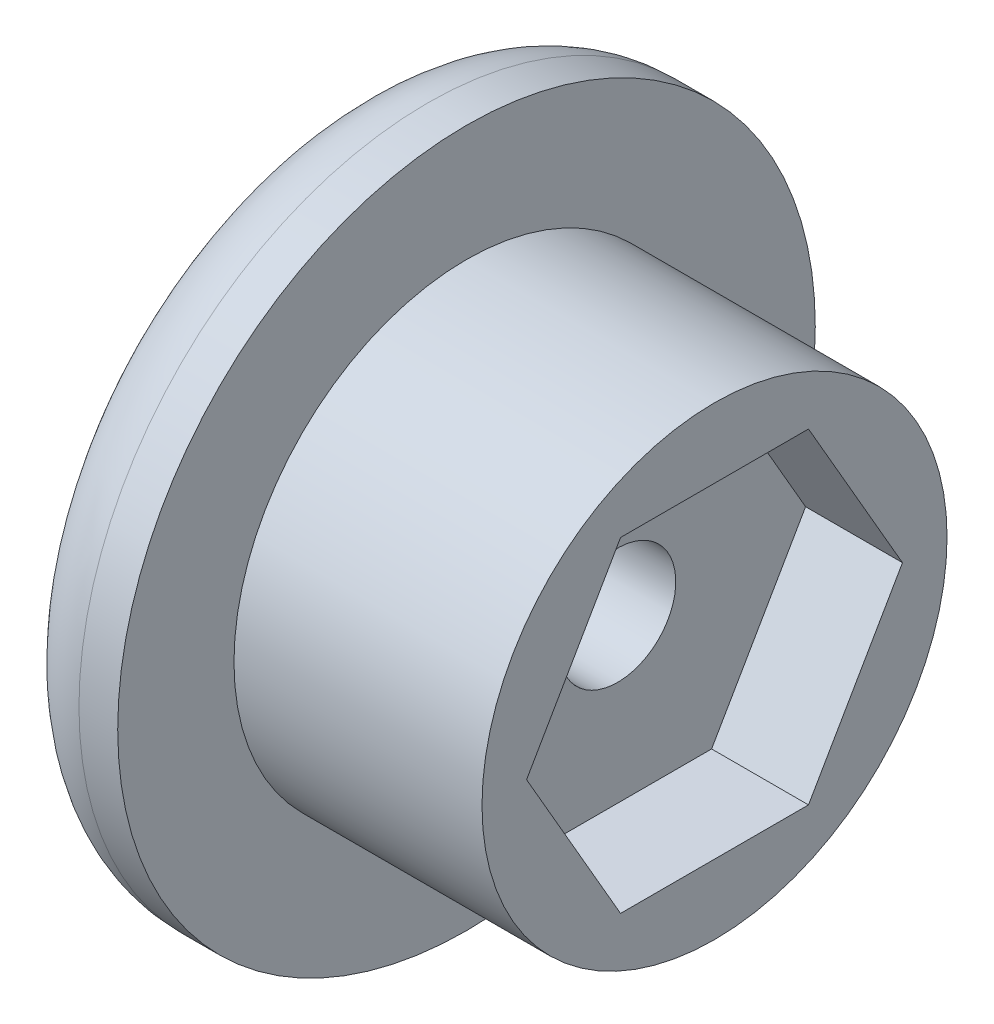
ISO-10303-21;
HEADER;
FILE_DESCRIPTION(('STEP AP214'),'2;1');
FILE_NAME('part.step','',(''),(''),'','','');
FILE_SCHEMA(('AUTOMOTIVE_DESIGN { 1 0 10303 214 1 1 1 1 }'));
ENDSEC;
DATA;
#1=APPLICATION_CONTEXT('core data for automotive mechanical design processes');
#2=APPLICATION_PROTOCOL_DEFINITION('international standard','automotive_design',2000,#1);
#3=PRODUCT_CONTEXT('',#1,'mechanical');
#4=PRODUCT('Part','Part','',(#3));
#5=PRODUCT_RELATED_PRODUCT_CATEGORY('part','',(#4));
#6=PRODUCT_DEFINITION_FORMATION('','',#4);
#7=PRODUCT_DEFINITION_CONTEXT('part definition',#1,'design');
#8=PRODUCT_DEFINITION('design','',#6,#7);
#9=PRODUCT_DEFINITION_SHAPE('','',#8);
#10=(LENGTH_UNIT() NAMED_UNIT(*) SI_UNIT(.MILLI.,.METRE.));
#11=(NAMED_UNIT(*) PLANE_ANGLE_UNIT() SI_UNIT($,.RADIAN.));
#12=(NAMED_UNIT(*) SI_UNIT($,.STERADIAN.) SOLID_ANGLE_UNIT());
#13=UNCERTAINTY_MEASURE_WITH_UNIT(LENGTH_MEASURE(1.E-05),#10,'distance_accuracy_value','');
#14=(GEOMETRIC_REPRESENTATION_CONTEXT(3) GLOBAL_UNCERTAINTY_ASSIGNED_CONTEXT((#13)) GLOBAL_UNIT_ASSIGNED_CONTEXT((#10,
#11,#12)) REPRESENTATION_CONTEXT('',''));
#15=CARTESIAN_POINT('',(0.,0.,0.));
#16=DIRECTION('',(0.,0.,1.));
#17=DIRECTION('',(1.,0.,0.));
#18=AXIS2_PLACEMENT_3D('',#15,#16,#17);
#19=CARTESIAN_POINT('',(-27.169607513477,-8.93633316158706,65.25));
#20=DIRECTION('',(1.,0.,0.));
#21=DIRECTION('',(0.,0.,-1.));
#22=AXIS2_PLACEMENT_3D('',#19,#20,#21);
#23=CYLINDRICAL_SURFACE('',#22,6.);
#24=CARTESIAN_POINT('',(-24.669607513477,-8.93633316158706,65.25));
#25=DIRECTION('',(-1.,0.,0.));
#26=DIRECTION('',(0.,0.,1.));
#27=AXIS2_PLACEMENT_3D('',#24,#25,#26);
#28=CIRCLE('',#27,6.);
#29=CARTESIAN_POINT('',(-24.669607513477,-8.93633316158706,71.25));
#30=VERTEX_POINT('',#29);
#31=EDGE_CURVE('E121',#30,#30,#28,.T.);
#32=ORIENTED_EDGE('',*,*,#31,.T.);
#33=EDGE_LOOP('',(#32));
#34=FACE_BOUND('',#33,.T.);
#35=CARTESIAN_POINT('',(-31.069607513477,-8.93633316158706,65.25));
#36=DIRECTION('',(-1.,0.,0.));
#37=DIRECTION('',(0.,-1.,0.));
#38=AXIS2_PLACEMENT_3D('',#35,#36,#37);
#39=CIRCLE('',#38,6.);
#40=CARTESIAN_POINT('',(-31.069607513477,-14.9363331615871,65.25));
#41=VERTEX_POINT('',#40);
#42=EDGE_CURVE('E124',#41,#41,#39,.T.);
#43=ORIENTED_EDGE('',*,*,#42,.F.);
#44=EDGE_LOOP('',(#43));
#45=FACE_BOUND('',#44,.T.);
#46=ADVANCED_FACE('F34',(#34,#45),#23,.T.);
#47=CARTESIAN_POINT('',(-20.169607513477,-8.93633316158706,65.25));
#48=DIRECTION('',(-1.,0.,0.));
#49=DIRECTION('',(0.,0.,1.));
#50=AXIS2_PLACEMENT_3D('',#47,#48,#49);
#51=CYLINDRICAL_SURFACE('',#50,1.5);
#52=CARTESIAN_POINT('',(-27.169607513477,-8.93633316158706,65.25));
#53=DIRECTION('',(-1.,0.,0.));
#54=DIRECTION('',(0.,0.,1.));
#55=AXIS2_PLACEMENT_3D('',#52,#53,#54);
#56=CIRCLE('',#55,1.5);
#57=CARTESIAN_POINT('',(-27.169607513477,-8.93633316158706,66.75));
#58=VERTEX_POINT('',#57);
#59=EDGE_CURVE('E127',#58,#58,#56,.T.);
#60=ORIENTED_EDGE('',*,*,#59,.F.);
#61=EDGE_LOOP('',(#60));
#62=FACE_BOUND('',#61,.T.);
#63=CARTESIAN_POINT('',(-29.669607513477,-8.93633316158706,65.25));
#64=DIRECTION('',(-1.,0.,0.));
#65=DIRECTION('',(0.,0.,1.));
#66=AXIS2_PLACEMENT_3D('',#63,#64,#65);
#67=CIRCLE('',#66,1.5);
#68=CARTESIAN_POINT('',(-29.669607513477,-8.93633316158706,66.75));
#69=VERTEX_POINT('',#68);
#70=EDGE_CURVE('E125',#69,#69,#67,.F.);
#71=ORIENTED_EDGE('',*,*,#70,.F.);
#72=EDGE_LOOP('',(#71));
#73=FACE_BOUND('',#72,.T.);
#74=ADVANCED_FACE('F184',(#62,#73),#51,.F.);
#75=CARTESIAN_POINT('',(-24.669607513477,-8.93633316158706,65.25));
#76=DIRECTION('',(-1.,0.,0.));
#77=DIRECTION('',(0.,0.,1.));
#78=AXIS2_PLACEMENT_3D('',#75,#76,#77);
#79=PLANE('',#78);
#80=ORIENTED_EDGE('',*,*,#31,.F.);
#81=EDGE_LOOP('',(#80));
#82=FACE_BOUND('',#81,.T.);
#83=DIRECTION('',(0.,0.866025403784438,-0.500000000000001));
#84=VECTOR('',#83,1.);
#85=CARTESIAN_POINT('',(-24.669607513477,-8.93633316158706,70.0997422611929));
#86=LINE('',#85,#84);
#87=CARTESIAN_POINT('',(-24.669607513477,-8.93633316158706,70.0997422611929));
#88=VERTEX_POINT('',#87);
#89=CARTESIAN_POINT('',(-24.669607513477,-4.73633316158706,67.6748711305964));
#90=VERTEX_POINT('',#89);
#91=EDGE_CURVE('E49',#88,#90,#86,.T.);
#92=ORIENTED_EDGE('',*,*,#91,.T.);
#93=DIRECTION('',(0.,0.,-1.));
#94=VECTOR('',#93,1.);
#95=CARTESIAN_POINT('',(-24.669607513477,-4.73633316158706,67.6748711305964));
#96=LINE('',#95,#94);
#97=CARTESIAN_POINT('',(-24.669607513477,-4.73633316158706,62.8251288694036));
#98=VERTEX_POINT('',#97);
#99=EDGE_CURVE('E106',#90,#98,#96,.T.);
#100=ORIENTED_EDGE('',*,*,#99,.T.);
#101=DIRECTION('',(0.,-0.866025403784438,-0.500000000000001));
#102=VECTOR('',#101,1.);
#103=CARTESIAN_POINT('',(-24.669607513477,-4.73633316158706,62.8251288694036));
#104=LINE('',#103,#102);
#105=CARTESIAN_POINT('',(-24.669607513477,-8.93633316158705,60.4002577388072));
#106=VERTEX_POINT('',#105);
#107=EDGE_CURVE('E104',#98,#106,#104,.T.);
#108=ORIENTED_EDGE('',*,*,#107,.T.);
#109=DIRECTION('',(0.,-0.866025403784438,0.500000000000001));
#110=VECTOR('',#109,1.);
#111=CARTESIAN_POINT('',(-24.669607513477,-8.93633316158705,60.4002577388072));
#112=LINE('',#111,#110);
#113=CARTESIAN_POINT('',(-24.669607513477,-13.1363331615871,62.8251288694036));
#114=VERTEX_POINT('',#113);
#115=EDGE_CURVE('E84',#106,#114,#112,.T.);
#116=ORIENTED_EDGE('',*,*,#115,.T.);
#117=DIRECTION('',(0.,0.,1.));
#118=VECTOR('',#117,1.);
#119=CARTESIAN_POINT('',(-24.669607513477,-13.1363331615871,62.8251288694036));
#120=LINE('',#119,#118);
#121=CARTESIAN_POINT('',(-24.669607513477,-13.1363331615871,67.6748711305964));
#122=VERTEX_POINT('',#121);
#123=EDGE_CURVE('E93',#114,#122,#120,.T.);
#124=ORIENTED_EDGE('',*,*,#123,.T.);
#125=DIRECTION('',(0.,0.866025403784438,0.500000000000001));
#126=VECTOR('',#125,1.);
#127=CARTESIAN_POINT('',(-24.669607513477,-13.1363331615871,67.6748711305964));
#128=LINE('',#127,#126);
#129=EDGE_CURVE('E99',#122,#88,#128,.T.);
#130=ORIENTED_EDGE('',*,*,#129,.T.);
#131=EDGE_LOOP('',(#92,#100,#108,#116,#124,#130));
#132=FACE_BOUND('',#131,.T.);
#133=ADVANCED_FACE('F101',(#82,#132),#79,.F.);
#134=CARTESIAN_POINT('',(-27.169607513477,-8.93633316158706,70.0997422611929));
#135=DIRECTION('',(0.,-0.500000000000001,-0.866025403784438));
#136=DIRECTION('',(0.,0.866025403784438,-0.500000000000001));
#137=AXIS2_PLACEMENT_3D('',#134,#135,#136);
#138=PLANE('',#137);
#139=ORIENTED_EDGE('',*,*,#91,.F.);
#140=DIRECTION('',(1.,0.,0.));
#141=VECTOR('',#140,1.);
#142=CARTESIAN_POINT('',(-27.169607513477,-8.93633316158706,70.0997422611929));
#143=LINE('',#142,#141);
#144=CARTESIAN_POINT('',(-27.169607513477,-8.93633316158706,70.0997422611929));
#145=VERTEX_POINT('',#144);
#146=EDGE_CURVE('E112',#145,#88,#143,.T.);
#147=ORIENTED_EDGE('',*,*,#146,.F.);
#148=DIRECTION('',(0.,0.866025403784438,-0.500000000000001));
#149=VECTOR('',#148,1.);
#150=CARTESIAN_POINT('',(-27.169607513477,-8.93633316158706,70.0997422611929));
#151=LINE('',#150,#149);
#152=CARTESIAN_POINT('',(-27.169607513477,-4.73633316158706,67.6748711305964));
#153=VERTEX_POINT('',#152);
#154=EDGE_CURVE('E111',#145,#153,#151,.T.);
#155=ORIENTED_EDGE('',*,*,#154,.T.);
#156=DIRECTION('',(1.,0.,0.));
#157=VECTOR('',#156,1.);
#158=CARTESIAN_POINT('',(-27.169607513477,-4.73633316158706,67.6748711305964));
#159=LINE('',#158,#157);
#160=EDGE_CURVE('E119',#153,#90,#159,.T.);
#161=ORIENTED_EDGE('',*,*,#160,.T.);
#162=EDGE_LOOP('',(#139,#147,#155,#161));
#163=FACE_BOUND('',#162,.T.);
#164=ADVANCED_FACE('F160',(#163),#138,.T.);
#165=CARTESIAN_POINT('',(-27.169607513477,-4.73633316158706,67.6748711305964));
#166=DIRECTION('',(0.,-1.,0.));
#167=DIRECTION('',(0.,0.,-1.));
#168=AXIS2_PLACEMENT_3D('',#165,#166,#167);
#169=PLANE('',#168);
#170=ORIENTED_EDGE('',*,*,#99,.F.);
#171=ORIENTED_EDGE('',*,*,#160,.F.);
#172=DIRECTION('',(0.,0.,-1.));
#173=VECTOR('',#172,1.);
#174=CARTESIAN_POINT('',(-27.169607513477,-4.73633316158706,67.6748711305964));
#175=LINE('',#174,#173);
#176=CARTESIAN_POINT('',(-27.169607513477,-4.73633316158706,62.8251288694036));
#177=VERTEX_POINT('',#176);
#178=EDGE_CURVE('E146',#153,#177,#175,.T.);
#179=ORIENTED_EDGE('',*,*,#178,.T.);
#180=DIRECTION('',(1.,0.,0.));
#181=VECTOR('',#180,1.);
#182=CARTESIAN_POINT('',(-27.169607513477,-4.73633316158706,62.8251288694036));
#183=LINE('',#182,#181);
#184=EDGE_CURVE('E117',#177,#98,#183,.T.);
#185=ORIENTED_EDGE('',*,*,#184,.T.);
#186=EDGE_LOOP('',(#170,#171,#179,#185));
#187=FACE_BOUND('',#186,.T.);
#188=ADVANCED_FACE('F158',(#187),#169,.T.);
#189=CARTESIAN_POINT('',(-27.169607513477,-4.73633316158706,62.8251288694036));
#190=DIRECTION('',(0.,-0.500000000000001,0.866025403784438));
#191=DIRECTION('',(0.,-0.866025403784438,-0.500000000000001));
#192=AXIS2_PLACEMENT_3D('',#189,#190,#191);
#193=PLANE('',#192);
#194=ORIENTED_EDGE('',*,*,#107,.F.);
#195=ORIENTED_EDGE('',*,*,#184,.F.);
#196=DIRECTION('',(0.,-0.866025403784438,-0.500000000000001));
#197=VECTOR('',#196,1.);
#198=CARTESIAN_POINT('',(-27.169607513477,-4.73633316158706,62.8251288694036));
#199=LINE('',#198,#197);
#200=CARTESIAN_POINT('',(-27.169607513477,-8.93633316158705,60.4002577388072));
#201=VERTEX_POINT('',#200);
#202=EDGE_CURVE('E149',#177,#201,#199,.T.);
#203=ORIENTED_EDGE('',*,*,#202,.T.);
#204=DIRECTION('',(1.,0.,0.));
#205=VECTOR('',#204,1.);
#206=CARTESIAN_POINT('',(-27.169607513477,-8.93633316158705,60.4002577388072));
#207=LINE('',#206,#205);
#208=EDGE_CURVE('E89',#201,#106,#207,.T.);
#209=ORIENTED_EDGE('',*,*,#208,.T.);
#210=EDGE_LOOP('',(#194,#195,#203,#209));
#211=FACE_BOUND('',#210,.T.);
#212=ADVANCED_FACE('F174',(#211),#193,.T.);
#213=CARTESIAN_POINT('',(-27.169607513477,-8.93633316158705,60.4002577388072));
#214=DIRECTION('',(0.,0.500000000000001,0.866025403784438));
#215=DIRECTION('',(0.,-0.866025403784438,0.500000000000001));
#216=AXIS2_PLACEMENT_3D('',#213,#214,#215);
#217=PLANE('',#216);
#218=ORIENTED_EDGE('',*,*,#115,.F.);
#219=ORIENTED_EDGE('',*,*,#208,.F.);
#220=DIRECTION('',(0.,-0.866025403784438,0.500000000000001));
#221=VECTOR('',#220,1.);
#222=CARTESIAN_POINT('',(-27.169607513477,-8.93633316158705,60.4002577388072));
#223=LINE('',#222,#221);
#224=CARTESIAN_POINT('',(-27.169607513477,-13.1363331615871,62.8251288694036));
#225=VERTEX_POINT('',#224);
#226=EDGE_CURVE('E58',#201,#225,#223,.T.);
#227=ORIENTED_EDGE('',*,*,#226,.T.);
#228=DIRECTION('',(1.,0.,0.));
#229=VECTOR('',#228,1.);
#230=CARTESIAN_POINT('',(-27.169607513477,-13.1363331615871,62.8251288694036));
#231=LINE('',#230,#229);
#232=EDGE_CURVE('E79',#225,#114,#231,.T.);
#233=ORIENTED_EDGE('',*,*,#232,.T.);
#234=EDGE_LOOP('',(#218,#219,#227,#233));
#235=FACE_BOUND('',#234,.T.);
#236=ADVANCED_FACE('F81',(#235),#217,.T.);
#237=CARTESIAN_POINT('',(-27.169607513477,-13.1363331615871,62.8251288694036));
#238=DIRECTION('',(0.,1.,0.));
#239=DIRECTION('',(0.,0.,1.));
#240=AXIS2_PLACEMENT_3D('',#237,#238,#239);
#241=PLANE('',#240);
#242=ORIENTED_EDGE('',*,*,#123,.F.);
#243=ORIENTED_EDGE('',*,*,#232,.F.);
#244=DIRECTION('',(0.,0.,1.));
#245=VECTOR('',#244,1.);
#246=CARTESIAN_POINT('',(-27.169607513477,-13.1363331615871,62.8251288694036));
#247=LINE('',#246,#245);
#248=CARTESIAN_POINT('',(-27.169607513477,-13.1363331615871,67.6748711305964));
#249=VERTEX_POINT('',#248);
#250=EDGE_CURVE('E152',#225,#249,#247,.T.);
#251=ORIENTED_EDGE('',*,*,#250,.T.);
#252=DIRECTION('',(1.,0.,0.));
#253=VECTOR('',#252,1.);
#254=CARTESIAN_POINT('',(-27.169607513477,-13.1363331615871,67.6748711305964));
#255=LINE('',#254,#253);
#256=EDGE_CURVE('E90',#249,#122,#255,.T.);
#257=ORIENTED_EDGE('',*,*,#256,.T.);
#258=EDGE_LOOP('',(#242,#243,#251,#257));
#259=FACE_BOUND('',#258,.T.);
#260=ADVANCED_FACE('F94',(#259),#241,.T.);
#261=CARTESIAN_POINT('',(-27.169607513477,-13.1363331615871,67.6748711305964));
#262=DIRECTION('',(0.,0.500000000000001,-0.866025403784438));
#263=DIRECTION('',(0.,0.866025403784438,0.500000000000001));
#264=AXIS2_PLACEMENT_3D('',#261,#262,#263);
#265=PLANE('',#264);
#266=ORIENTED_EDGE('',*,*,#129,.F.);
#267=ORIENTED_EDGE('',*,*,#256,.F.);
#268=DIRECTION('',(0.,0.866025403784438,0.500000000000001));
#269=VECTOR('',#268,1.);
#270=CARTESIAN_POINT('',(-27.169607513477,-13.1363331615871,67.6748711305964));
#271=LINE('',#270,#269);
#272=EDGE_CURVE('E114',#249,#145,#271,.T.);
#273=ORIENTED_EDGE('',*,*,#272,.T.);
#274=ORIENTED_EDGE('',*,*,#146,.T.);
#275=EDGE_LOOP('',(#266,#267,#273,#274));
#276=FACE_BOUND('',#275,.T.);
#277=ADVANCED_FACE('F168',(#276),#265,.T.);
#278=CARTESIAN_POINT('',(-27.169607513477,-8.93633316158706,65.25));
#279=DIRECTION('',(-1.,0.,0.));
#280=DIRECTION('',(0.,0.,1.));
#281=AXIS2_PLACEMENT_3D('',#278,#279,#280);
#282=PLANE('',#281);
#283=ORIENTED_EDGE('',*,*,#59,.T.);
#284=EDGE_LOOP('',(#283));
#285=FACE_BOUND('',#284,.T.);
#286=ORIENTED_EDGE('',*,*,#178,.F.);
#287=ORIENTED_EDGE('',*,*,#154,.F.);
#288=ORIENTED_EDGE('',*,*,#272,.F.);
#289=ORIENTED_EDGE('',*,*,#250,.F.);
#290=ORIENTED_EDGE('',*,*,#226,.F.);
#291=ORIENTED_EDGE('',*,*,#202,.F.);
#292=EDGE_LOOP('',(#286,#287,#288,#289,#290,#291));
#293=FACE_BOUND('',#292,.T.);
#294=ADVANCED_FACE('F165',(#285,#293),#282,.F.);
#295=CARTESIAN_POINT('',(-29.669607513477,-8.93633316158706,65.25));
#296=DIRECTION('',(-1.,0.,0.));
#297=DIRECTION('',(0.,0.,1.));
#298=AXIS2_PLACEMENT_3D('',#295,#296,#297);
#299=PLANE('',#298);
#300=CARTESIAN_POINT('',(-29.669607513477,-8.93633316158706,65.25));
#301=DIRECTION('',(-1.,0.,0.));
#302=DIRECTION('',(0.,0.,1.));
#303=AXIS2_PLACEMENT_3D('',#300,#301,#302);
#304=CIRCLE('',#303,3.00000000000001);
#305=CARTESIAN_POINT('',(-29.669607513477,-8.93633316158706,68.25));
#306=VERTEX_POINT('',#305);
#307=EDGE_CURVE('E128',#306,#306,#304,.T.);
#308=ORIENTED_EDGE('',*,*,#307,.T.);
#309=EDGE_LOOP('',(#308));
#310=FACE_BOUND('',#309,.T.);
#311=ORIENTED_EDGE('',*,*,#70,.T.);
#312=EDGE_LOOP('',(#311));
#313=FACE_BOUND('',#312,.T.);
#314=ADVANCED_FACE('F240',(#310,#313),#299,.T.);
#315=CARTESIAN_POINT('',(-29.669607513477,-8.93633316158706,65.25));
#316=DIRECTION('',(-1.,0.,0.));
#317=DIRECTION('',(0.,0.,1.));
#318=AXIS2_PLACEMENT_3D('',#315,#316,#317);
#319=CYLINDRICAL_SURFACE('',#318,3.00000000000001);
#320=ORIENTED_EDGE('',*,*,#307,.F.);
#321=EDGE_LOOP('',(#320));
#322=FACE_BOUND('',#321,.T.);
#323=CARTESIAN_POINT('',(-34.069607513477,-8.93633316158706,65.25));
#324=DIRECTION('',(-1.,0.,0.));
#325=DIRECTION('',(0.,-1.,0.));
#326=AXIS2_PLACEMENT_3D('',#323,#324,#325);
#327=CIRCLE('',#326,3.00000000000001);
#328=CARTESIAN_POINT('',(-34.069607513477,-11.9363331615871,65.25));
#329=VERTEX_POINT('',#328);
#330=EDGE_CURVE('E318',#329,#329,#327,.T.);
#331=ORIENTED_EDGE('',*,*,#330,.T.);
#332=EDGE_LOOP('',(#331));
#333=FACE_BOUND('',#332,.T.);
#334=ADVANCED_FACE('F255',(#322,#333),#319,.F.);
#335=CARTESIAN_POINT('',(-31.069607513477,-8.93633316158706,65.25));
#336=DIRECTION('',(-1.,0.,0.));
#337=DIRECTION('',(0.,-1.,0.));
#338=AXIS2_PLACEMENT_3D('',#335,#336,#337);
#339=PLANE('',#338);
#340=CARTESIAN_POINT('',(-31.069607513477,-8.93633316158706,65.25));
#341=DIRECTION('',(-1.,0.,0.));
#342=DIRECTION('',(0.,-1.,0.));
#343=AXIS2_PLACEMENT_3D('',#340,#341,#342);
#344=CIRCLE('',#343,9.);
#345=CARTESIAN_POINT('',(-31.069607513477,-17.9363331615871,65.25));
#346=VERTEX_POINT('',#345);
#347=EDGE_CURVE('E138',#346,#346,#344,.T.);
#348=ORIENTED_EDGE('',*,*,#347,.F.);
#349=EDGE_LOOP('',(#348));
#350=FACE_BOUND('',#349,.T.);
#351=ORIENTED_EDGE('',*,*,#42,.T.);
#352=EDGE_LOOP('',(#351));
#353=FACE_BOUND('',#352,.T.);
#354=ADVANCED_FACE('F272',(#350,#353),#339,.F.);
#355=CARTESIAN_POINT('',(-34.069607513477,-8.93633316158706,65.25));
#356=DIRECTION('',(-1.,0.,0.));
#357=DIRECTION('',(0.,-1.,0.));
#358=AXIS2_PLACEMENT_3D('',#355,#356,#357);
#359=PLANE('',#358);
#360=CARTESIAN_POINT('',(-34.069607513477,-8.93633316158706,65.25));
#361=DIRECTION('',(-1.,0.,0.));
#362=DIRECTION('',(0.,-1.,0.));
#363=AXIS2_PLACEMENT_3D('',#360,#361,#362);
#364=CIRCLE('',#363,7.);
#365=CARTESIAN_POINT('',(-34.069607513477,-15.9363331615871,65.25));
#366=VERTEX_POINT('',#365);
#367=EDGE_CURVE('E42',#366,#366,#364,.T.);
#368=ORIENTED_EDGE('',*,*,#367,.T.);
#369=EDGE_LOOP('',(#368));
#370=FACE_BOUND('',#369,.T.);
#371=ORIENTED_EDGE('',*,*,#330,.F.);
#372=EDGE_LOOP('',(#371));
#373=FACE_BOUND('',#372,.T.);
#374=ADVANCED_FACE('F282',(#370,#373),#359,.T.);
#375=CARTESIAN_POINT('',(-34.069607513477,-8.93633316158706,65.25));
#376=DIRECTION('',(1.,0.,0.));
#377=DIRECTION('',(0.,1.,0.));
#378=AXIS2_PLACEMENT_3D('',#375,#376,#377);
#379=CYLINDRICAL_SURFACE('',#378,9.);
#380=CARTESIAN_POINT('',(-32.069607513477,-8.93633316158706,65.25));
#381=DIRECTION('',(-1.,0.,0.));
#382=DIRECTION('',(0.,-1.,0.));
#383=AXIS2_PLACEMENT_3D('',#380,#381,#382);
#384=CIRCLE('',#383,9.);
#385=CARTESIAN_POINT('',(-32.069607513477,-17.9363331615871,65.25));
#386=VERTEX_POINT('',#385);
#387=EDGE_CURVE('E11',#386,#386,#384,.F.);
#388=ORIENTED_EDGE('',*,*,#387,.T.);
#389=EDGE_LOOP('',(#388));
#390=FACE_BOUND('',#389,.T.);
#391=ORIENTED_EDGE('',*,*,#347,.T.);
#392=EDGE_LOOP('',(#391));
#393=FACE_BOUND('',#392,.T.);
#394=ADVANCED_FACE('F292',(#390,#393),#379,.T.);
#395=CARTESIAN_POINT('',(-32.069607513477,-8.93633316158706,65.25));
#396=DIRECTION('',(-1.,0.,0.));
#397=DIRECTION('',(0.,-1.,0.));
#398=AXIS2_PLACEMENT_3D('',#395,#396,#397);
#399=TOROIDAL_SURFACE('',#398,7.,2.);
#400=ORIENTED_EDGE('',*,*,#387,.F.);
#401=EDGE_LOOP('',(#400));
#402=FACE_BOUND('',#401,.T.);
#403=ORIENTED_EDGE('',*,*,#367,.F.);
#404=EDGE_LOOP('',(#403));
#405=FACE_BOUND('',#404,.T.);
#406=ADVANCED_FACE('F36',(#402,#405),#399,.T.);
#407=CLOSED_SHELL('',(#46,#74,#133,#164,#188,#212,#236,#260,#277,#294,#314,#334,#354,#374,#394,#406));
#408=MANIFOLD_SOLID_BREP('B2',#407);
#409=ADVANCED_BREP_SHAPE_REPRESENTATION('',(#18,#408),#14);
#410=SHAPE_DEFINITION_REPRESENTATION(#9,#409);
ENDSEC;
END-ISO-10303-21;
